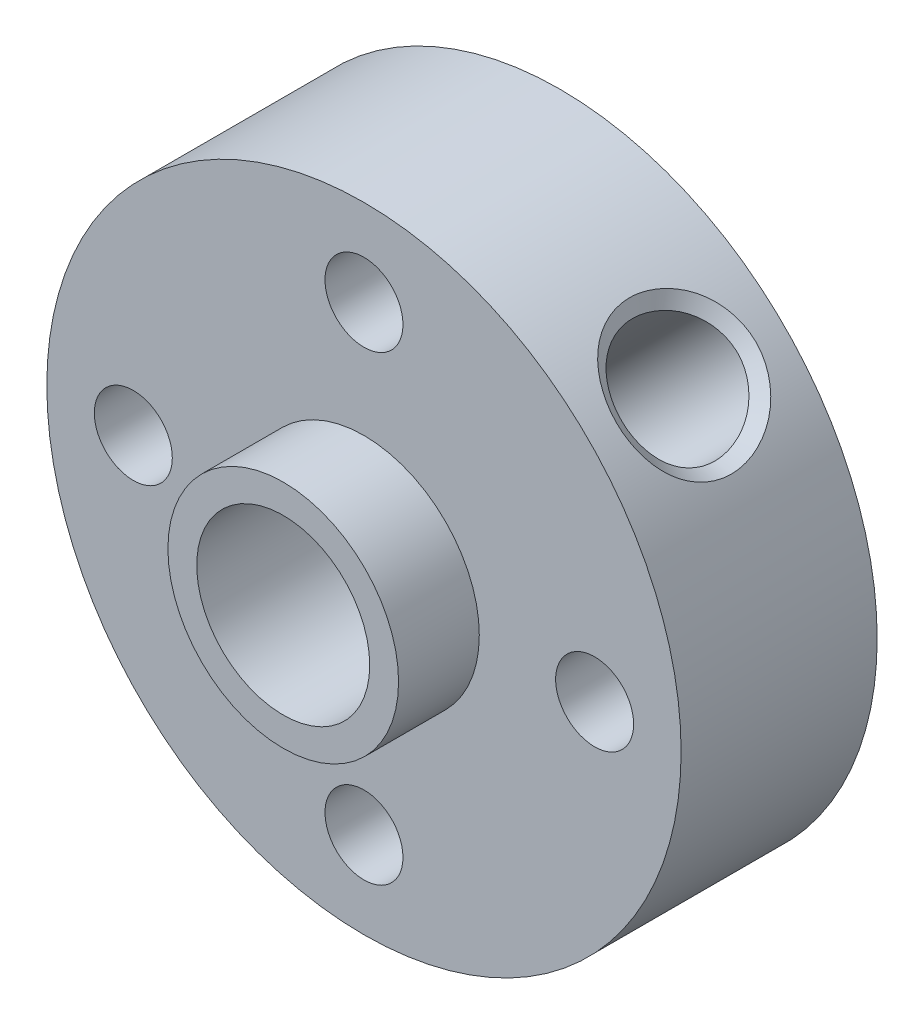
ISO-10303-21;
HEADER;
FILE_DESCRIPTION(('STEP AP214'),'2;1');
FILE_NAME('part.step','',(''),(''),'','','');
FILE_SCHEMA(('AUTOMOTIVE_DESIGN { 1 0 10303 214 1 1 1 1 }'));
ENDSEC;
DATA;
#1=APPLICATION_CONTEXT('core data for automotive mechanical design processes');
#2=APPLICATION_PROTOCOL_DEFINITION('international standard','automotive_design',2000,#1);
#3=PRODUCT_CONTEXT('',#1,'mechanical');
#4=PRODUCT('Part','Part','',(#3));
#5=PRODUCT_RELATED_PRODUCT_CATEGORY('part','',(#4));
#6=PRODUCT_DEFINITION_FORMATION('','',#4);
#7=PRODUCT_DEFINITION_CONTEXT('part definition',#1,'design');
#8=PRODUCT_DEFINITION('design','',#6,#7);
#9=PRODUCT_DEFINITION_SHAPE('','',#8);
#10=(LENGTH_UNIT() NAMED_UNIT(*) SI_UNIT(.MILLI.,.METRE.));
#11=(NAMED_UNIT(*) PLANE_ANGLE_UNIT() SI_UNIT($,.RADIAN.));
#12=(NAMED_UNIT(*) SI_UNIT($,.STERADIAN.) SOLID_ANGLE_UNIT());
#13=UNCERTAINTY_MEASURE_WITH_UNIT(LENGTH_MEASURE(1.E-05),#10,'distance_accuracy_value','');
#14=(GEOMETRIC_REPRESENTATION_CONTEXT(3) GLOBAL_UNCERTAINTY_ASSIGNED_CONTEXT((#13)) GLOBAL_UNIT_ASSIGNED_CONTEXT((#10,
#11,#12)) REPRESENTATION_CONTEXT('',''));
#15=CARTESIAN_POINT('',(0.,0.,0.));
#16=DIRECTION('',(0.,0.,1.));
#17=DIRECTION('',(1.,0.,0.));
#18=AXIS2_PLACEMENT_3D('',#15,#16,#17);
#19=CARTESIAN_POINT('',(0.,0.,3.4));
#20=DIRECTION('',(0.,0.,1.));
#21=DIRECTION('',(1.,0.,0.));
#22=AXIS2_PLACEMENT_3D('',#19,#20,#21);
#23=PLANE('',#22);
#24=CARTESIAN_POINT('',(0.,8.,3.4));
#25=DIRECTION('',(0.,0.,1.));
#26=DIRECTION('',(1.,0.,0.));
#27=AXIS2_PLACEMENT_3D('',#24,#25,#26);
#28=CIRCLE('',#27,1.35254999999999);
#29=CARTESIAN_POINT('',(1.35254999999999,8.,3.4));
#30=VERTEX_POINT('',#29);
#31=EDGE_CURVE('E165',#30,#30,#28,.T.);
#32=ORIENTED_EDGE('',*,*,#31,.F.);
#33=EDGE_LOOP('',(#32));
#34=FACE_BOUND('',#33,.T.);
#35=CARTESIAN_POINT('',(-8.,0.,3.4));
#36=DIRECTION('',(0.,0.,1.));
#37=DIRECTION('',(1.,0.,0.));
#38=AXIS2_PLACEMENT_3D('',#35,#36,#37);
#39=CIRCLE('',#38,1.35254999999999);
#40=CARTESIAN_POINT('',(-6.64745000000002,0.,3.4));
#41=VERTEX_POINT('',#40);
#42=EDGE_CURVE('E157',#41,#41,#39,.T.);
#43=ORIENTED_EDGE('',*,*,#42,.F.);
#44=EDGE_LOOP('',(#43));
#45=FACE_BOUND('',#44,.T.);
#46=CARTESIAN_POINT('',(8.,0.,3.4));
#47=DIRECTION('',(0.,0.,1.));
#48=DIRECTION('',(1.,0.,0.));
#49=AXIS2_PLACEMENT_3D('',#46,#47,#48);
#50=CIRCLE('',#49,1.35254999999999);
#51=CARTESIAN_POINT('',(9.35254999999998,0.,3.4));
#52=VERTEX_POINT('',#51);
#53=EDGE_CURVE('E152',#52,#52,#50,.T.);
#54=ORIENTED_EDGE('',*,*,#53,.F.);
#55=EDGE_LOOP('',(#54));
#56=FACE_BOUND('',#55,.T.);
#57=CARTESIAN_POINT('',(0.,-8.,3.4));
#58=DIRECTION('',(0.,0.,1.));
#59=DIRECTION('',(1.,0.,0.));
#60=AXIS2_PLACEMENT_3D('',#57,#58,#59);
#61=CIRCLE('',#60,1.35254999999999);
#62=CARTESIAN_POINT('',(1.35254999999999,-8.,3.4));
#63=VERTEX_POINT('',#62);
#64=EDGE_CURVE('E75',#63,#63,#61,.T.);
#65=ORIENTED_EDGE('',*,*,#64,.F.);
#66=EDGE_LOOP('',(#65));
#67=FACE_BOUND('',#66,.T.);
#68=CARTESIAN_POINT('',(0.,0.,3.4));
#69=DIRECTION('',(0.,0.,1.));
#70=DIRECTION('',(1.,0.,0.));
#71=AXIS2_PLACEMENT_3D('',#68,#69,#70);
#72=CIRCLE('',#71,11.);
#73=CARTESIAN_POINT('',(11.,0.,3.4));
#74=VERTEX_POINT('',#73);
#75=EDGE_CURVE('E36',#74,#74,#72,.T.);
#76=ORIENTED_EDGE('',*,*,#75,.T.);
#77=EDGE_LOOP('',(#76));
#78=FACE_BOUND('',#77,.T.);
#79=CARTESIAN_POINT('',(0.,0.,3.4));
#80=DIRECTION('',(0.,0.,1.));
#81=DIRECTION('',(1.,0.,0.));
#82=AXIS2_PLACEMENT_3D('',#79,#80,#81);
#83=CIRCLE('',#82,4.);
#84=CARTESIAN_POINT('',(4.,0.,3.4));
#85=VERTEX_POINT('',#84);
#86=EDGE_CURVE('E44',#85,#85,#83,.T.);
#87=ORIENTED_EDGE('',*,*,#86,.F.);
#88=EDGE_LOOP('',(#87));
#89=FACE_BOUND('',#88,.T.);
#90=ADVANCED_FACE('F14',(#34,#45,#56,#67,#78,#89),#23,.T.);
#91=CARTESIAN_POINT('',(0.,0.,-3.4));
#92=DIRECTION('',(0.,0.,1.));
#93=DIRECTION('',(1.,0.,0.));
#94=AXIS2_PLACEMENT_3D('',#91,#92,#93);
#95=CYLINDRICAL_SURFACE('',#94,11.);
#96=CARTESIAN_POINT('',(5.80850921114971,9.34137145948008,0.));
#97=CARTESIAN_POINT('',(5.80860175270186,9.34130684226353,0.637752239425181));
#98=CARTESIAN_POINT('',(6.04841944563921,9.19795689630476,1.26506432985481));
#99=CARTESIAN_POINT('',(6.80772994268232,8.6547578245762,2.1593530444314));
#100=CARTESIAN_POINT('',(7.31255506753503,8.24383991985221,2.42181611028022));
#101=CARTESIAN_POINT('',(8.24208780154512,7.31421539613681,2.42137394363942));
#102=CARTESIAN_POINT('',(8.65342910417239,6.80927509037896,2.16023058528547));
#103=CARTESIAN_POINT('',(9.19833006953286,6.04820111625001,1.26575073384544));
#104=CARTESIAN_POINT('',(9.34130756360716,5.80859981124356,0.640244269694807));
#105=CARTESIAN_POINT('',(9.34143535072448,5.80841861849953,-0.63996115444348));
#106=CARTESIAN_POINT('',(9.19862099961548,6.04773368941902,-1.26485137218771));
#107=CARTESIAN_POINT('',(8.65403117260026,6.8085025567722,-2.15966842361701));
#108=CARTESIAN_POINT('',(8.24214650834189,7.31418190369822,-2.42143639363606));
#109=CARTESIAN_POINT('',(7.31242801405934,8.24394174367863,-2.42175361413118));
#110=CARTESIAN_POINT('',(6.80825671047602,8.65433029295559,-2.15959971653594));
#111=CARTESIAN_POINT('',(6.04869975760828,9.19780320357039,-1.26576913530237));
#112=CARTESIAN_POINT('',(5.80841666959756,9.34143607669663,-0.637752239425181));
#113=CARTESIAN_POINT('',(5.80850921114971,9.34137145948008,0.));
#114=B_SPLINE_CURVE_WITH_KNOTS('',3,(#96,#97,#98,#99,#100,#101,#102,#103,#104,#105,#106,#107,
#108,#109,#110,#111,#112,#113),.UNSPECIFIED.,.T.,.F.,(4,2,2,2,2,2,2,2,4),(-3.18999496817969E-06,
0.00189587305523977,0.00379493610544774,0.00569399915565569,0.00759306220586365,
0.0094921252560716,0.0113911883062796,0.0132902513564875,0.0151893144066955),.UNSPECIFIED.);
#115=CARTESIAN_POINT('',(5.80850921114971,9.34137145948008,0.));
#116=VERTEX_POINT('',#115);
#117=EDGE_CURVE('E9',#116,#116,#114,.F.);
#118=ORIENTED_EDGE('',*,*,#117,.T.);
#119=EDGE_LOOP('',(#118));
#120=FACE_BOUND('',#119,.T.);
#121=CARTESIAN_POINT('',(0.,0.,-3.4));
#122=DIRECTION('',(0.,0.,1.));
#123=DIRECTION('',(1.,0.,0.));
#124=AXIS2_PLACEMENT_3D('',#121,#122,#123);
#125=CIRCLE('',#124,11.);
#126=CARTESIAN_POINT('',(11.,0.,-3.4));
#127=VERTEX_POINT('',#126);
#128=EDGE_CURVE('E31',#127,#127,#125,.T.);
#129=ORIENTED_EDGE('',*,*,#128,.T.);
#130=EDGE_LOOP('',(#129));
#131=FACE_BOUND('',#130,.T.);
#132=ORIENTED_EDGE('',*,*,#75,.F.);
#133=EDGE_LOOP('',(#132));
#134=FACE_BOUND('',#133,.T.);
#135=ADVANCED_FACE('F90',(#120,#131,#134),#95,.T.);
#136=CARTESIAN_POINT('',(0.,0.,-3.4));
#137=DIRECTION('',(0.,0.,1.));
#138=DIRECTION('',(1.,0.,0.));
#139=AXIS2_PLACEMENT_3D('',#136,#137,#138);
#140=PLANE('',#139);
#141=CARTESIAN_POINT('',(0.,8.,-3.4));
#142=DIRECTION('',(0.,0.,1.));
#143=DIRECTION('',(1.,0.,0.));
#144=AXIS2_PLACEMENT_3D('',#141,#142,#143);
#145=CIRCLE('',#144,1.35255);
#146=CARTESIAN_POINT('',(1.35255,8.,-3.4));
#147=VERTEX_POINT('',#146);
#148=EDGE_CURVE('E168',#147,#147,#145,.T.);
#149=ORIENTED_EDGE('',*,*,#148,.T.);
#150=EDGE_LOOP('',(#149));
#151=FACE_BOUND('',#150,.T.);
#152=CARTESIAN_POINT('',(-8.,0.,-3.4));
#153=DIRECTION('',(0.,0.,1.));
#154=DIRECTION('',(1.,0.,0.));
#155=AXIS2_PLACEMENT_3D('',#152,#153,#154);
#156=CIRCLE('',#155,1.35255);
#157=CARTESIAN_POINT('',(-6.64745,0.,-3.4));
#158=VERTEX_POINT('',#157);
#159=EDGE_CURVE('E162',#158,#158,#156,.T.);
#160=ORIENTED_EDGE('',*,*,#159,.T.);
#161=EDGE_LOOP('',(#160));
#162=FACE_BOUND('',#161,.T.);
#163=CARTESIAN_POINT('',(8.,0.,-3.4));
#164=DIRECTION('',(0.,0.,1.));
#165=DIRECTION('',(1.,0.,0.));
#166=AXIS2_PLACEMENT_3D('',#163,#164,#165);
#167=CIRCLE('',#166,1.35255);
#168=CARTESIAN_POINT('',(9.35255,0.,-3.4));
#169=VERTEX_POINT('',#168);
#170=EDGE_CURVE('E149',#169,#169,#167,.T.);
#171=ORIENTED_EDGE('',*,*,#170,.T.);
#172=EDGE_LOOP('',(#171));
#173=FACE_BOUND('',#172,.T.);
#174=CARTESIAN_POINT('',(0.,-8.,-3.4));
#175=DIRECTION('',(0.,0.,1.));
#176=DIRECTION('',(1.,0.,0.));
#177=AXIS2_PLACEMENT_3D('',#174,#175,#176);
#178=CIRCLE('',#177,1.35255);
#179=CARTESIAN_POINT('',(1.35255,-8.,-3.4));
#180=VERTEX_POINT('',#179);
#181=EDGE_CURVE('E154',#180,#180,#178,.T.);
#182=ORIENTED_EDGE('',*,*,#181,.T.);
#183=EDGE_LOOP('',(#182));
#184=FACE_BOUND('',#183,.T.);
#185=CARTESIAN_POINT('',(0.,0.,-3.4));
#186=DIRECTION('',(0.,0.,1.));
#187=DIRECTION('',(1.,0.,0.));
#188=AXIS2_PLACEMENT_3D('',#185,#186,#187);
#189=CIRCLE('',#188,3.);
#190=CARTESIAN_POINT('',(3.,0.,-3.4));
#191=VERTEX_POINT('',#190);
#192=EDGE_CURVE('E77',#191,#191,#189,.T.);
#193=ORIENTED_EDGE('',*,*,#192,.T.);
#194=EDGE_LOOP('',(#193));
#195=FACE_BOUND('',#194,.T.);
#196=ORIENTED_EDGE('',*,*,#128,.F.);
#197=EDGE_LOOP('',(#196));
#198=FACE_BOUND('',#197,.T.);
#199=ADVANCED_FACE('F98',(#151,#162,#173,#184,#195,#198),#140,.F.);
#200=CARTESIAN_POINT('',(0.,0.,6.2));
#201=DIRECTION('',(0.,0.,-1.));
#202=DIRECTION('',(-1.,0.,0.));
#203=AXIS2_PLACEMENT_3D('',#200,#201,#202);
#204=CYLINDRICAL_SURFACE('',#203,4.);
#205=CARTESIAN_POINT('',(0.,0.,6.2));
#206=DIRECTION('',(0.,0.,1.));
#207=DIRECTION('',(1.,0.,0.));
#208=AXIS2_PLACEMENT_3D('',#205,#206,#207);
#209=CIRCLE('',#208,4.);
#210=CARTESIAN_POINT('',(4.,0.,6.2));
#211=VERTEX_POINT('',#210);
#212=EDGE_CURVE('E41',#211,#211,#209,.T.);
#213=ORIENTED_EDGE('',*,*,#212,.F.);
#214=EDGE_LOOP('',(#213));
#215=FACE_BOUND('',#214,.T.);
#216=ORIENTED_EDGE('',*,*,#86,.T.);
#217=EDGE_LOOP('',(#216));
#218=FACE_BOUND('',#217,.T.);
#219=ADVANCED_FACE('F87',(#215,#218),#204,.T.);
#220=CARTESIAN_POINT('',(0.,0.,6.2));
#221=DIRECTION('',(0.,0.,1.));
#222=DIRECTION('',(1.,0.,0.));
#223=AXIS2_PLACEMENT_3D('',#220,#221,#222);
#224=PLANE('',#223);
#225=CARTESIAN_POINT('',(0.,0.,6.2));
#226=DIRECTION('',(0.,0.,1.));
#227=DIRECTION('',(1.,0.,0.));
#228=AXIS2_PLACEMENT_3D('',#225,#226,#227);
#229=CIRCLE('',#228,3.);
#230=CARTESIAN_POINT('',(3.,0.,6.2));
#231=VERTEX_POINT('',#230);
#232=EDGE_CURVE('E74',#231,#231,#229,.T.);
#233=ORIENTED_EDGE('',*,*,#232,.F.);
#234=EDGE_LOOP('',(#233));
#235=FACE_BOUND('',#234,.T.);
#236=ORIENTED_EDGE('',*,*,#212,.T.);
#237=EDGE_LOOP('',(#236));
#238=FACE_BOUND('',#237,.T.);
#239=ADVANCED_FACE('F183',(#235,#238),#224,.T.);
#240=CARTESIAN_POINT('',(0.,0.,-3.4));
#241=DIRECTION('',(0.,0.,1.));
#242=DIRECTION('',(1.,0.,0.));
#243=AXIS2_PLACEMENT_3D('',#240,#241,#242);
#244=CYLINDRICAL_SURFACE('',#243,3.);
#245=CARTESIAN_POINT('',(0.140964874131704,2.99668632063168,0.));
#246=CARTESIAN_POINT('',(0.140973596425941,2.99668877876177,0.098267140159155));
#247=CARTESIAN_POINT('',(0.150783604937548,2.99627297936712,0.196560340717473));
#248=CARTESIAN_POINT('',(0.188643120098594,2.99411844316388,0.389604395758761));
#249=CARTESIAN_POINT('',(0.216725857438611,2.99237729510123,0.484348463165478));
#250=CARTESIAN_POINT('',(0.287566324055804,2.98639263110845,0.66688445970502));
#251=CARTESIAN_POINT('',(0.330177706650297,2.98217377806388,0.75473536524163));
#252=CARTESIAN_POINT('',(0.426893750215522,2.96987148458312,0.923482005054036));
#253=CARTESIAN_POINT('',(0.481000510439045,2.96178733794049,1.00437646516826));
#254=CARTESIAN_POINT('',(0.607371814508557,2.93868158824322,1.17102358549829));
#255=CARTESIAN_POINT('',(0.681155761442132,2.92276043053348,1.25549942358805));
#256=CARTESIAN_POINT('',(0.837366259695036,2.88190070504922,1.41373187372428));
#257=CARTESIAN_POINT('',(0.919802265197736,2.8569521986231,1.48747654534154));
#258=CARTESIAN_POINT('',(1.10320182024356,2.79173209928646,1.63306183144041));
#259=CARTESIAN_POINT('',(1.20509710343995,2.74973294137712,1.70298665445154));
#260=CARTESIAN_POINT('',(1.4119470706209,2.64944107376143,1.82407543706995));
#261=CARTESIAN_POINT('',(1.5168957838101,2.59117846972164,1.87527366118514));
#262=CARTESIAN_POINT('',(1.6983111335789,2.47472666269574,1.9455593679438));
#263=CARTESIAN_POINT('',(1.77528377164386,2.42022704728202,1.96948922093329));
#264=CARTESIAN_POINT('',(1.92547501725124,2.30252473801262,2.00392935112861));
#265=CARTESIAN_POINT('',(1.99869643227694,2.2393286872687,2.01444980926693));
#266=CARTESIAN_POINT('',(2.13910271892289,2.10562450185853,2.02149290497818));
#267=CARTESIAN_POINT('',(2.20627759644525,2.03510466171401,2.01799278762426));
#268=CARTESIAN_POINT('',(2.33255181669655,1.88905481044295,1.99715109462227));
#269=CARTESIAN_POINT('',(2.39164876160439,1.81352332151886,1.9798054195195));
#270=CARTESIAN_POINT('',(2.49971448548471,1.6613245603167,1.93261511708822));
#271=CARTESIAN_POINT('',(2.54883956691533,1.58469897586444,1.90298992616388));
#272=CARTESIAN_POINT('',(2.63800401251086,1.43136695290519,1.83253576097941));
#273=CARTESIAN_POINT('',(2.67804165557309,1.35466050184169,1.7917046676226));
#274=CARTESIAN_POINT('',(2.75345510104509,1.19463975046345,1.69496537461078));
#275=CARTESIAN_POINT('',(2.787796675907,1.11155525713123,1.63787646031066));
#276=CARTESIAN_POINT('',(2.84685752106799,0.950160561205841,1.51289259923298));
#277=CARTESIAN_POINT('',(2.87156539243244,0.871856106322447,1.44498498434907));
#278=CARTESIAN_POINT('',(2.91617925734933,0.709970040641031,1.28735653708993));
#279=CARTESIAN_POINT('',(2.93460347692185,0.627676256550689,1.19588619316171));
#280=CARTESIAN_POINT('',(2.96281033229786,0.477090854407041,1.00082926242336));
#281=CARTESIAN_POINT('',(2.97259833935265,0.408790553499582,0.897250252007682));
#282=CARTESIAN_POINT('',(2.98472399555785,0.305700690591401,0.705076019136407));
#283=CARTESIAN_POINT('',(2.98827953437657,0.266804690510231,0.618771187162269));
#284=CARTESIAN_POINT('',(2.9932640661576,0.20344642709279,0.441001259055672));
#285=CARTESIAN_POINT('',(2.99469691073788,0.178958069975086,0.349545822562629));
#286=CARTESIAN_POINT('',(2.99644764308712,0.146905797540694,0.162887188750376));
#287=CARTESIAN_POINT('',(2.99675683226214,0.139474085605024,0.0676604975433));
#288=CARTESIAN_POINT('',(2.9965921652876,0.142957841234305,-0.122460732300091));
#289=CARTESIAN_POINT('',(2.99611823788278,0.153874978350537,-0.217355239923924));
#290=CARTESIAN_POINT('',(2.99399098429709,0.190510510754693,-0.393616029634496));
#291=CARTESIAN_POINT('',(2.99246806736947,0.214536399222093,-0.475349718918807));
#292=CARTESIAN_POINT('',(2.98761013947686,0.273996768931334,-0.634495549889999));
#293=CARTESIAN_POINT('',(2.98427350540983,0.30944145730809,-0.711903752153196));
#294=CARTESIAN_POINT('',(2.97276792056859,0.407474824178516,-0.895005102536816));
#295=CARTESIAN_POINT('',(2.96310685021584,0.475117716846531,-0.997902056013123));
#296=CARTESIAN_POINT('',(2.93530525081688,0.624307012293902,-1.1918810771684));
#297=CARTESIAN_POINT('',(2.91714920976135,0.705878675557201,-1.28294114009789));
#298=CARTESIAN_POINT('',(2.86951418569794,0.879847726851796,-1.45317948195013));
#299=CARTESIAN_POINT('',(2.83989321425106,0.972370343170876,-1.53219071618379));
#300=CARTESIAN_POINT('',(2.76706735719638,1.16351196906968,-1.67500399877634));
#301=CARTESIAN_POINT('',(2.72388451741606,1.26212087737287,-1.73883043728458));
#302=CARTESIAN_POINT('',(2.63147402705235,1.44352768804252,-1.83891618100895));
#303=CARTESIAN_POINT('',(2.58472178406086,1.52598736934383,-1.87806706719257));
#304=CARTESIAN_POINT('',(2.48079979491718,1.68967604018048,-1.94283627640381));
#305=CARTESIAN_POINT('',(2.42363680374714,1.77090579094942,-1.9684633325463));
#306=CARTESIAN_POINT('',(2.29931281205703,1.92960053352643,-2.00489733174875));
#307=CARTESIAN_POINT('',(2.23210753109171,2.00704672689031,-2.01563635576009));
#308=CARTESIAN_POINT('',(2.08973540745282,2.1548847498933,-2.02138037996191));
#309=CARTESIAN_POINT('',(2.01456988198504,2.22527774290684,-2.01638797935981));
#310=CARTESIAN_POINT('',(1.86495146837063,2.35177058731536,-1.99198783716143));
#311=CARTESIAN_POINT('',(1.790883027932,2.40855160452958,-1.9737107864744));
#312=CARTESIAN_POINT('',(1.64061098326316,2.51332292185118,-1.92496500434514));
#313=CARTESIAN_POINT('',(1.5644070389501,2.56131181251842,-1.89449432066586));
#314=CARTESIAN_POINT('',(1.40792958231886,2.65071645149137,-1.82063779440984));
#315=CARTESIAN_POINT('',(1.32766176522853,2.69162825481495,-1.7766360099734));
#316=CARTESIAN_POINT('',(1.16951120459241,2.76402268465499,-1.67792532616774));
#317=CARTESIAN_POINT('',(1.09162983972056,2.79549994963953,-1.62321036772058));
#318=CARTESIAN_POINT('',(0.928302223601383,2.85428183648066,-1.49489928218128));
#319=CARTESIAN_POINT('',(0.843606433218719,2.88014015450953,-1.4196856967384));
#320=CARTESIAN_POINT('',(0.683120162751906,2.92236843279855,-1.25783818901386));
#321=CARTESIAN_POINT('',(0.607336969846977,2.93873067122702,-1.17119504273096));
#322=CARTESIAN_POINT('',(0.472662666130018,2.96327075304597,-0.993172326488883));
#323=CARTESIAN_POINT('',(0.413007984872816,2.97189939899243,-0.902435363617874));
#324=CARTESIAN_POINT('',(0.308525072370767,2.98455844193639,-0.712517066078894));
#325=CARTESIAN_POINT('',(0.26367022825823,2.98859712487761,-0.613351296432072));
#326=CARTESIAN_POINT('',(0.200250851842448,2.99344447063229,-0.428720030428275));
#327=CARTESIAN_POINT('',(0.178227081671669,2.99473669600436,-0.344466780193642));
#328=CARTESIAN_POINT('',(0.148588007584803,2.99635601576172,-0.173480606452646));
#329=CARTESIAN_POINT('',(0.140957174070217,2.99668415058877,-0.0867504581809685));
#330=CARTESIAN_POINT('',(0.140964874131704,2.99668632063168,0.));
#331=B_SPLINE_CURVE_WITH_KNOTS('',3,(#245,#246,#247,#248,#249,#250,#251,#252,#253,#254,#255,
#256,#257,#258,#259,#260,#261,#262,#263,#264,#265,#266,#267,#268,#269,#270,#271,#272,#273,#274,
#275,#276,#277,#278,#279,#280,#281,#282,#283,#284,#285,#286,#287,#288,#289,#290,#291,#292,#293,
#294,#295,#296,#297,#298,#299,#300,#301,#302,#303,#304,#305,#306,#307,#308,#309,#310,#311,#312,
#313,#314,#315,#316,#317,#318,#319,#320,#321,#322,#323,#324,#325,#326,#327,#328,#329,#330),
.UNSPECIFIED.,.T.,.F.,(4,2,2,2,2,2,2,2,2,2,2,2,2,2,2,2,2,2,2,2,2,2,2,2,2,2,2,2,2,2,2,2,2,2,2,2,
2,2,2,2,2,2,4),(0.,0.294403536380051,0.589343975595897,0.881397200780219,1.17350380579789,
1.51211387476107,1.85109787614565,2.24051778682945,2.62922155934116,2.91986353918584,
3.21028472066951,3.50117743686839,3.79215631384675,4.0781454004206,4.36418860638471,
4.68247532658299,5.00113752008124,5.37279099606919,5.7442131606791,6.02735164683166,
6.3099757476852,6.59478313131645,6.8796164308116,7.13424228210731,7.38909637504133,
7.75770005887129,8.12697946404345,8.50098664778866,8.87438897473934,9.18078287749255,
9.48697868121594,9.79456680098563,10.1021041025096,10.3861411287428,10.6702236483578,
10.9698648671405,11.2696760468771,11.6168834583152,11.9643728107565,12.2899631035632,
12.6149646923712,12.8751457033016,13.1350458248448),.UNSPECIFIED.);
#332=CARTESIAN_POINT('',(0.140964874131704,2.99668632063168,0.));
#333=VERTEX_POINT('',#332);
#334=EDGE_CURVE('E68',#333,#333,#331,.T.);
#335=ORIENTED_EDGE('',*,*,#334,.T.);
#336=EDGE_LOOP('',(#335));
#337=FACE_BOUND('',#336,.T.);
#338=ORIENTED_EDGE('',*,*,#192,.F.);
#339=EDGE_LOOP('',(#338));
#340=FACE_BOUND('',#339,.T.);
#341=ORIENTED_EDGE('',*,*,#232,.T.);
#342=EDGE_LOOP('',(#341));
#343=FACE_BOUND('',#342,.T.);
#344=ADVANCED_FACE('F62',(#337,#340,#343),#244,.F.);
#345=CARTESIAN_POINT('',(7.77817459305204,7.77817459305201,0.));
#346=DIRECTION('',(0.707106781186549,0.707106781186546,0.));
#347=DIRECTION('',(-0.707106781186546,0.707106781186549,0.));
#348=AXIS2_PLACEMENT_3D('',#345,#346,#347);
#349=CYLINDRICAL_SURFACE('',#348,2.0193);
#350=CARTESIAN_POINT('',(5.91506401697902,8.77078546347897,0.));
#351=CARTESIAN_POINT('',(5.91505848231522,8.77078895441068,-0.0332110676749033));
#352=CARTESIAN_POINT('',(5.91584250371787,8.77036908136087,-0.0664205027334047));
#353=CARTESIAN_POINT('',(5.91894801804012,8.7686844720424,-0.132706000824395));
#354=CARTESIAN_POINT('',(5.9212676546673,8.76742075581777,-0.165782176435809));
#355=CARTESIAN_POINT('',(5.92740096477233,8.76405141279832,-0.231730396913036));
#356=CARTESIAN_POINT('',(5.93121367555311,8.7619463284787,-0.264602559475341));
#357=CARTESIAN_POINT('',(5.94028892447994,8.75689761117119,-0.33007339450582));
#358=CARTESIAN_POINT('',(5.94555114052323,8.7539541644756,-0.362672126078209));
#359=CARTESIAN_POINT('',(5.95748172497235,8.74723181556497,-0.427526437618056));
#360=CARTESIAN_POINT('',(5.96415019887331,8.74345285066972,-0.4597819916501));
#361=CARTESIAN_POINT('',(5.97884975539384,8.73506249034032,-0.523880394046932));
#362=CARTESIAN_POINT('',(5.98688119889341,8.73045087442044,-0.5557231306983));
#363=CARTESIAN_POINT('',(6.00426333819006,8.72039813550141,-0.618926309415745));
#364=CARTESIAN_POINT('',(6.01361451659092,8.71495670899628,-0.650286570375672));
#365=CARTESIAN_POINT('',(6.03359289306655,8.70324720139475,-0.712455190591768));
#366=CARTESIAN_POINT('',(6.04422059736454,8.69697879224987,-0.74326332529229));
#367=CARTESIAN_POINT('',(6.06670888670971,8.68361811087546,-0.804258051751262));
#368=CARTESIAN_POINT('',(6.07856993563723,8.67652552854269,-0.834444404496179));
#369=CARTESIAN_POINT('',(6.10348184418441,8.66151925847352,-0.894125891486494));
#370=CARTESIAN_POINT('',(6.1165330880074,8.65360530547821,-0.923620798638449));
#371=CARTESIAN_POINT('',(6.14378232701951,8.63695899466251,-0.981849692064889));
#372=CARTESIAN_POINT('',(6.15798061459986,8.62822642807898,-1.01058348182969));
#373=CARTESIAN_POINT('',(6.18748098358667,8.60994569245589,-1.06722040540461));
#374=CARTESIAN_POINT('',(6.20278327541987,8.60039736786602,-1.0951233794192));
#375=CARTESIAN_POINT('',(6.23444834486617,8.58048749877546,-1.15002897367342));
#376=CARTESIAN_POINT('',(6.25081127954806,8.57012583378044,-1.17703145966052));
#377=CARTESIAN_POINT('',(6.28455556770699,8.54859326407028,-1.23006622575014));
#378=CARTESIAN_POINT('',(6.30193706947596,8.53742224146553,-1.25609836367374));
#379=CARTESIAN_POINT('',(6.33767164204864,8.51426907303072,-1.30712323462616));
#380=CARTESIAN_POINT('',(6.35602490834893,8.50228676385234,-1.33211575668862));
#381=CARTESIAN_POINT('',(6.39367379710448,8.47753119815555,-1.38098995191833));
#382=CARTESIAN_POINT('',(6.41296973283744,8.46475767831074,-1.40487125057307));
#383=CARTESIAN_POINT('',(6.45239380966425,8.43836765389058,-1.45144277207453));
#384=CARTESIAN_POINT('',(6.47252179241438,8.42475130946691,-1.47413321969916));
#385=CARTESIAN_POINT('',(6.5134758800685,8.396649933525,-1.51827896365429));
#386=CARTESIAN_POINT('',(6.53430150189429,8.38216549784591,-1.53973508781517));
#387=CARTESIAN_POINT('',(6.57659692078658,8.35237560191872,-1.58137915482345));
#388=CARTESIAN_POINT('',(6.59806639414692,8.33707055129586,-1.60156771966928));
#389=CARTESIAN_POINT('',(6.64157796071987,8.30566497179512,-1.64064582304461));
#390=CARTESIAN_POINT('',(6.66361982921347,8.28956475292206,-1.65953586105513));
#391=CARTESIAN_POINT('',(6.70820943365555,8.2566002077917,-1.69598536565466));
#392=CARTESIAN_POINT('',(6.73075699607696,8.23973614168032,-1.71354527988383));
#393=CARTESIAN_POINT('',(6.77629000761417,8.20527364445818,-1.74730308237524));
#394=CARTESIAN_POINT('',(6.79927530942781,8.18767545809094,-1.76350141922008));
#395=CARTESIAN_POINT('',(6.84561618019307,8.15177485327988,-1.79450451369917));
#396=CARTESIAN_POINT('',(6.8689716177549,8.13347268158225,-1.80930975345408));
#397=CARTESIAN_POINT('',(6.91598505694102,8.09619410943873,-1.83749507829371));
#398=CARTESIAN_POINT('',(6.93964294335847,8.07721796109371,-1.8508756889275));
#399=CARTESIAN_POINT('',(6.98719359976606,8.03862146663374,-1.87618016635322));
#400=CARTESIAN_POINT('',(7.01108627669856,8.01900136905854,-1.88810458698168));
#401=CARTESIAN_POINT('',(7.05903882080188,7.97914700798318,-1.91046511062842));
#402=CARTESIAN_POINT('',(7.08309862402779,7.95891297037337,-1.92090175318899));
#403=CARTESIAN_POINT('',(7.13131772267693,7.91786078233942,-1.94025519102211));
#404=CARTESIAN_POINT('',(7.15547698625862,7.89704280807243,-1.94917243903047));
#405=CARTESIAN_POINT('',(7.20382730656838,7.85485282469411,-1.96545562647138));
#406=CARTESIAN_POINT('',(7.22801835725751,7.83348090947037,-1.97282182688519));
#407=CARTESIAN_POINT('',(7.27636455934796,7.79021315756589,-1.9859715835014));
#408=CARTESIAN_POINT('',(7.30051970910263,7.76831729759626,-1.99175506921085));
#409=CARTESIAN_POINT('',(7.34872645183662,7.72403178920511,-2.0017081311534));
#410=CARTESIAN_POINT('',(7.37277800466268,7.7016419668764,-2.00587712907823));
#411=CARTESIAN_POINT('',(7.42070990754528,7.65639875033491,-2.01257039611203));
#412=CARTESIAN_POINT('',(7.44459010761541,7.63354500443547,-2.01509336544913));
#413=CARTESIAN_POINT('',(7.49211187188736,7.58740398851407,-2.01846297530972));
#414=CARTESIAN_POINT('',(7.51575306944567,7.56411617370421,-2.01930734284276));
#415=CARTESIAN_POINT('',(7.56268537381163,7.51718143523514,-2.01929214610317));
#416=CARTESIAN_POINT('',(7.58597640723569,7.49353443833363,-2.01843222954557));
#417=CARTESIAN_POINT('',(7.63213269087668,7.44599278654123,-2.01503739250119));
#418=CARTESIAN_POINT('',(7.65499833438958,7.42209839582679,-2.01250410727608));
#419=CARTESIAN_POINT('',(7.70027314745175,7.37413068840906,-2.00579376995031));
#420=CARTESIAN_POINT('',(7.72268252506742,7.35005746041972,-2.00161748558656));
#421=CARTESIAN_POINT('',(7.76701398076269,7.30180085174932,-1.99165308065752));
#422=CARTESIAN_POINT('',(7.78893610238859,7.2776174811464,-1.98586510476038));
#423=CARTESIAN_POINT('',(7.83226222533888,7.22920923113274,-1.97270874422235));
#424=CARTESIAN_POINT('',(7.85366613690358,7.20498434529829,-1.96534008793903));
#425=CARTESIAN_POINT('',(7.89592497299629,7.15656166922529,-1.94905366064103));
#426=CARTESIAN_POINT('',(7.91677971060389,7.13236389082917,-1.94013536983413));
#427=CARTESIAN_POINT('',(7.95790929380116,7.08406400516903,-1.92078078423956));
#428=CARTESIAN_POINT('',(7.97818389178886,7.05996194242694,-1.91034385253155));
#429=CARTESIAN_POINT('',(8.01812224950334,7.01192205696618,-1.88798297317344));
#430=CARTESIAN_POINT('',(8.03778573410585,6.98798431189645,-1.87605836754497));
#431=CARTESIAN_POINT('',(8.07647088550343,6.94034163726293,-1.85075303378893));
#432=CARTESIAN_POINT('',(8.09549227656628,6.91663681074189,-1.83737169026327));
#433=CARTESIAN_POINT('',(8.13286222382865,6.86952855499723,-1.80918371284057));
#434=CARTESIAN_POINT('',(8.15121052192307,6.8461252435794,-1.79437653992197));
#435=CARTESIAN_POINT('',(8.18720327904014,6.79968863480245,-1.76336770394077));
#436=CARTESIAN_POINT('',(8.20484750501893,6.77665546143918,-1.74716558467095));
#437=CARTESIAN_POINT('',(8.23940098478744,6.73102767566808,-1.71339764848218));
#438=CARTESIAN_POINT('',(8.25631002512714,6.70843319166701,-1.69583143959048));
#439=CARTESIAN_POINT('',(8.28936245658593,6.66375163283349,-1.65936614329797));
#440=CARTESIAN_POINT('',(8.30550563361525,6.64166470076169,-1.64046668682979));
#441=CARTESIAN_POINT('',(8.33699399859716,6.59806596681261,-1.6013657262551));
#442=CARTESIAN_POINT('',(8.35233893380897,6.57655434812704,-1.5811638142422));
#443=CARTESIAN_POINT('',(8.38220479917344,6.53417810328663,-1.53948894405403));
#444=CARTESIAN_POINT('',(8.39672538327564,6.51331375048717,-1.51801545970706));
#445=CARTESIAN_POINT('',(8.42489311596826,6.4722882785207,-1.47382811571225));
#446=CARTESIAN_POINT('',(8.43853973376537,6.45212759003504,-1.45111351751842));
#447=CARTESIAN_POINT('',(8.46498311220623,6.41264578919863,-1.4045022351673));
#448=CARTESIAN_POINT('',(8.47778006619722,6.39332448618788,-1.3806058221152));
#449=CARTESIAN_POINT('',(8.50257514167932,6.35563320480251,-1.33172197410268));
#450=CARTESIAN_POINT('',(8.51457408105177,6.33726225684294,-1.30673570103523));
#451=CARTESIAN_POINT('',(8.5377528699454,6.3015013268,-1.25573829303498));
#452=CARTESIAN_POINT('',(8.54893337535542,6.28411056183228,-1.22972800503157));
#453=CARTESIAN_POINT('',(8.57047851389438,6.25035520776225,-1.17674891016927));
#454=CARTESIAN_POINT('',(8.58084366898023,6.23398996354727,-1.14978073283481));
#455=CARTESIAN_POINT('',(8.60075497666371,6.20232675855255,-1.09495202742265));
#456=CARTESIAN_POINT('',(8.61030156068651,6.18702823636469,-1.06709198016873));
#457=CARTESIAN_POINT('',(8.62857424193247,6.15754073429502,-1.01054566085373));
#458=CARTESIAN_POINT('',(8.6373007052626,6.14335125980823,-0.98185976499946));
#459=CARTESIAN_POINT('',(8.65393118322941,6.11612384324089,-0.923727827713139));
#460=CARTESIAN_POINT('',(8.66183551201453,6.10308546160267,-0.894282082037684));
#461=CARTESIAN_POINT('',(8.67681986647411,6.07820231388728,-0.834696503956032));
#462=CARTESIAN_POINT('',(8.68390015394206,6.06635716888693,-0.804556895651183));
#463=CARTESIAN_POINT('',(8.69723453927415,6.04390255145558,-0.743649643103446));
#464=CARTESIAN_POINT('',(8.70348883246058,6.03329278696552,-0.712882149330103));
#465=CARTESIAN_POINT('',(8.71516936551008,6.01335096704361,-0.65078517879945));
#466=CARTESIAN_POINT('',(8.72059570606081,6.00401875626215,-0.619455770895428));
#467=CARTESIAN_POINT('',(8.73061849592326,5.98667402839745,-0.556301032430903));
#468=CARTESIAN_POINT('',(8.73521490889622,5.97866156910146,-0.524475680221499));
#469=CARTESIAN_POINT('',(8.74357604893017,5.96399825071929,-0.460395119679614));
#470=CARTESIAN_POINT('',(8.74734054591038,5.95734776834859,-0.428139795039581));
#471=CARTESIAN_POINT('',(8.75403611517924,5.94545020513707,-0.363265361084158));
#472=CARTESIAN_POINT('',(8.75696669272247,5.94020395750586,-0.330646047697538));
#473=CARTESIAN_POINT('',(8.76199275794242,5.93115651464901,-0.265109684300486));
#474=CARTESIAN_POINT('',(8.76408740155927,5.92735678017527,-0.232192367504743));
#475=CARTESIAN_POINT('',(8.76744000846942,5.9212438787935,-0.166126063866228));
#476=CARTESIAN_POINT('',(8.76869668102399,5.91893300538347,-0.132976798738421));
#477=CARTESIAN_POINT('',(8.77037188909036,5.91583898922573,-0.066512428263187));
#478=CARTESIAN_POINT('',(8.77078857901005,5.91505921066461,-0.0331971186146417));
#479=CARTESIAN_POINT('',(8.77078234422554,5.91506882985746,0.0334354198008994));
#480=CARTESIAN_POINT('',(8.77035936358661,5.91585833214921,0.0667526485478928));
#481=CARTESIAN_POINT('',(8.76867146473501,5.91897238819308,0.13322429658903));
#482=CARTESIAN_POINT('',(8.76740828879689,5.9212937652881,0.166378910068239));
#483=CARTESIAN_POINT('',(8.76404262761878,5.92742794695481,0.232458795725592));
#484=CARTESIAN_POINT('',(8.7619413437847,5.93123861650763,0.265384327842097));
#485=CARTESIAN_POINT('',(8.75690192757776,5.94030819641756,0.330939444120578));
#486=CARTESIAN_POINT('',(8.75396456516732,5.94556577413947,0.363569272205739));
#487=CARTESIAN_POINT('',(8.7472553538668,5.95748617552347,0.428466492217278));
#488=CARTESIAN_POINT('',(8.74348394143914,5.96414826411336,0.460734064467783));
#489=CARTESIAN_POINT('',(8.73510889001523,5.97883490576692,0.52484030722022));
#490=CARTESIAN_POINT('',(8.73050543884059,5.98685915131707,0.556679072780175));
#491=CARTESIAN_POINT('',(8.72046848535581,6.00422748816641,0.619861251959679));
#492=CARTESIAN_POINT('',(8.71503499303038,6.01357156358902,0.651204671532828));
#493=CARTESIAN_POINT('',(8.70334006221747,6.03353707477466,0.713329703342666));
#494=CARTESIAN_POINT('',(8.69707851221822,6.04415868256126,0.744111239275858));
#495=CARTESIAN_POINT('',(8.68372951263668,6.06663687147066,0.805046035453233));
#496=CARTESIAN_POINT('',(8.67664187185276,6.0784937384309,0.83519914833535));
#497=CARTESIAN_POINT('',(8.66164270405434,6.10340013586137,0.894810613656917));
#498=CARTESIAN_POINT('',(8.65373093354436,6.11645001867717,0.924268757591395));
#499=CARTESIAN_POINT('',(8.63708546101234,6.1437001608459,0.982423787635083));
#500=CARTESIAN_POINT('',(8.62835147637857,6.1579008155074,1.01112040761647));
#501=CARTESIAN_POINT('',(8.61006363456531,6.18741031938702,1.0676858834715));
#502=CARTESIAN_POINT('',(8.60050945492705,6.20271960408834,1.09555440793039));
#503=CARTESIAN_POINT('',(8.58058284492023,6.23440387837896,1.15039720437352));
#504=CARTESIAN_POINT('',(8.57021003759893,6.25077935830366,1.17737105617334));
#505=CARTESIAN_POINT('',(8.54864944445045,6.2845546751928,1.23035799961978));
#506=CARTESIAN_POINT('',(8.53746120026439,6.30195508720329,1.25637053833628));
#507=CARTESIAN_POINT('',(8.5142669232988,6.33773457120861,1.30736855221933));
#508=CARTESIAN_POINT('',(8.50226030619904,6.3561143403794,1.33235327267238));
#509=CARTESIAN_POINT('',(8.47744934140314,6.3938229438881,1.38122882200797));
#510=CARTESIAN_POINT('',(8.46464425050445,6.41315265876081,1.4051185947489));
#511=CARTESIAN_POINT('',(8.43818660196548,6.45264810788821,1.45171251711371));
#512=CARTESIAN_POINT('',(8.42453397317264,6.472813912287,1.47441656689832));
#513=CARTESIAN_POINT('',(8.39635830986087,6.51384425532209,1.51858066920914));
#514=CARTESIAN_POINT('',(8.38183596066717,6.53470823823056,1.5400416756681));
#515=CARTESIAN_POINT('',(8.351969724349,6.57707948460712,1.58168918955006));
#516=CARTESIAN_POINT('',(8.33662631249606,6.59858637281449,1.60187641986011));
#517=CARTESIAN_POINT('',(8.30514387938477,6.6421718620316,1.64094629790072));
#518=CARTESIAN_POINT('',(8.28900521800497,6.66425020233021,1.65982952661447));
#519=CARTESIAN_POINT('',(8.25596425137547,6.7089114379051,1.69626108459567));
#520=CARTESIAN_POINT('',(8.23906224475767,6.73149413415179,1.71380992880571));
#521=CARTESIAN_POINT('',(8.20452486185037,6.77709580693246,1.74754235960537));
#522=CARTESIAN_POINT('',(8.1868897618932,6.80011461732842,1.76372645378098));
#523=CARTESIAN_POINT('',(8.15091686836598,6.84652057975221,1.79469895545694));
#524=CARTESIAN_POINT('',(8.13257935010047,6.8699075853957,1.80948790205612));
#525=CARTESIAN_POINT('',(8.09523215855354,6.91698192631167,1.83763964193118));
#526=CARTESIAN_POINT('',(8.07622276636988,6.94066913338688,1.85100302244686));
#527=CARTESIAN_POINT('',(8.03756239098396,6.98827588717756,1.87627314501539));
#528=CARTESIAN_POINT('',(8.01791168882148,7.01219532897691,1.88818051455554));
#529=CARTESIAN_POINT('',(7.97799925524323,7.06019855062093,1.91050813867076));
#530=CARTESIAN_POINT('',(7.95773778839227,7.08428225591073,1.92092902624327));
#531=CARTESIAN_POINT('',(7.91663440543887,7.13254599725071,1.94025324141825));
#532=CARTESIAN_POINT('',(7.8957927125758,7.15672599326698,1.94915714353737));
#533=CARTESIAN_POINT('',(7.85355948229104,7.20511430797544,1.96541702019326));
#534=CARTESIAN_POINT('',(7.83216809594916,7.22932261717638,1.97277341505298));
#535=CARTESIAN_POINT('',(7.78886610971863,7.27769954816383,1.98590795958636));
#536=CARTESIAN_POINT('',(7.76695555486784,7.30186817319984,1.99168624562014));
#537=CARTESIAN_POINT('',(7.72264590918634,7.35009777931911,2.00163456225323));
#538=CARTESIAN_POINT('',(7.70024672405602,7.37415873852492,2.00580427946512));
#539=CARTESIAN_POINT('',(7.65499047475318,7.42210497878789,2.01250496091493));
#540=CARTESIAN_POINT('',(7.63213314873969,7.44599014806073,2.01503495878187));
#541=CARTESIAN_POINT('',(7.58599149586351,7.49351729355972,2.01842835834536));
#542=CARTESIAN_POINT('',(7.5627067222944,7.51715896970547,2.01928990301142));
#543=CARTESIAN_POINT('',(7.51578332169805,7.56408705345293,2.01930962548455));
#544=CARTESIAN_POINT('',(7.49214471288097,7.58737347921392,2.01846789065385));
#545=CARTESIAN_POINT('',(7.44462381284622,7.63351476265405,2.01510067480987));
#546=CARTESIAN_POINT('',(7.42074184574882,7.65637010175521,2.01257720237531));
#547=CARTESIAN_POINT('',(7.37280291219216,7.70161931472156,2.00588137793343));
#548=CARTESIAN_POINT('',(7.34874606889904,7.72401347747058,2.00171009336103));
#549=CARTESIAN_POINT('',(7.30052578359064,7.76830992133872,1.99175074429619));
#550=CARTESIAN_POINT('',(7.27636236810444,7.79021231742479,1.98596306203394));
#551=CARTESIAN_POINT('',(7.22799728700026,7.83349492235518,1.97280342889561));
#552=CARTESIAN_POINT('',(7.20379561933122,7.85487510211202,1.9654313899939));
#553=CARTESIAN_POINT('',(7.15542231471128,7.89708289606742,1.94913516554283));
#554=CARTESIAN_POINT('',(7.13125068661975,7.91791037294386,1.94021059834436));
#555=CARTESIAN_POINT('',(7.08300571479043,7.95898235211534,1.92084131379504));
#556=CARTESIAN_POINT('',(7.05893240880988,7.97922664576155,1.91039606027584));
#557=CARTESIAN_POINT('',(7.0109523232803,8.01910180559519,1.8880172512124));
#558=CARTESIAN_POINT('',(6.98704561336613,8.03873242597797,1.87608310861397));
#559=CARTESIAN_POINT('',(6.93946696699172,8.07734975240179,1.8507582721155));
#560=CARTESIAN_POINT('',(6.91579512590907,8.0963362038629,1.83736701094931));
#561=CARTESIAN_POINT('',(6.8687544685808,8.13363466655914,1.80915961919991));
#562=CARTESIAN_POINT('',(6.84538576357308,8.15194643451098,1.7943429814633));
#563=CARTESIAN_POINT('',(6.79901966627931,8.1878650143029,1.76331647829971));
#564=CARTESIAN_POINT('',(6.77602239247154,8.20547160375713,1.74710617835879));
#565=CARTESIAN_POINT('',(6.73046736854324,8.23994918296968,1.71332398716207));
#566=CARTESIAN_POINT('',(6.70790974153644,8.25681996827336,1.69575172118233));
#567=CARTESIAN_POINT('',(6.66330255203771,8.28979573602846,1.65927722399221));
#568=CARTESIAN_POINT('',(6.64125312562119,8.3059005145746,1.64037464194535));
#569=CARTESIAN_POINT('',(6.59772965029765,8.33731244865267,1.60127126221301));
#570=CARTESIAN_POINT('',(6.57625577402795,8.3526193661371,1.58107008105079));
#571=CARTESIAN_POINT('',(6.53395523867463,8.38240989608554,1.53940098090521));
#572=CARTESIAN_POINT('',(6.51312883517612,8.39689318525287,1.51793257114709));
#573=CARTESIAN_POINT('',(6.47217803913618,8.42498803995151,1.47376178901991));
#574=CARTESIAN_POINT('',(6.45205404773519,8.43859911096003,1.45105872989051));
#575=CARTESIAN_POINT('',(6.412641607477,8.46497605881706,1.40446505449887));
#576=CARTESIAN_POINT('',(6.39335320313625,8.47774189065399,1.38057437511064));
#577=CARTESIAN_POINT('',(6.35572093883282,8.50248187164733,1.33168729517015));
#578=CARTESIAN_POINT('',(6.33737663534314,8.51445639331655,1.30669142427597));
#579=CARTESIAN_POINT('',(6.30166169734439,8.53759335612589,1.25566428331663));
#580=CARTESIAN_POINT('',(6.28429074951755,8.54875605893468,1.22963335109846));
#581=CARTESIAN_POINT('',(6.25056870684025,8.57027174436702,1.17660500376648));
#582=CARTESIAN_POINT('',(6.23421735963792,8.58062492750963,1.14960783042252));
#583=CARTESIAN_POINT('',(6.20257622039538,8.60051776117262,1.09471617141338));
#584=CARTESIAN_POINT('',(6.1872861844547,8.61005759872417,1.06682189408277));
#585=CARTESIAN_POINT('',(6.15781064536435,8.62832151976732,1.01020504839583));
#586=CARTESIAN_POINT('',(6.14362486468715,8.63704580833864,0.981482690660229));
#587=CARTESIAN_POINT('',(6.11640053174703,8.65367593934065,0.923278698234416));
#588=CARTESIAN_POINT('',(6.10336164199339,8.66158202266287,0.893797290230083));
#589=CARTESIAN_POINT('',(6.07847390199302,8.67657315080217,0.834144193561217));
#590=CARTESIAN_POINT('',(6.06662464633154,8.68365847545264,0.803972744388655));
#591=CARTESIAN_POINT('',(6.04415897116503,8.69700545914624,0.743008567902711));
#592=CARTESIAN_POINT('',(6.03354209196648,8.70326742542992,0.712216077309765));
#593=CARTESIAN_POINT('',(6.01358395877872,8.71496508544354,0.650078836254119));
#594=CARTESIAN_POINT('',(6.00424222922454,8.72040108730158,0.61873429662839));
#595=CARTESIAN_POINT('',(5.98687714517838,8.73044423505152,0.555561996395582));
#596=CARTESIAN_POINT('',(5.97885336575347,8.73505164814228,0.523734395166795));
#597=CARTESIAN_POINT('',(5.96416685879513,8.74343508029985,0.459665040752808));
#598=CARTESIAN_POINT('',(5.95750385493659,8.74721126817108,0.427423373065972));
#599=CARTESIAN_POINT('',(5.94558149634992,8.753929758751,0.362594950113253));
#600=CARTESIAN_POINT('',(5.9403221465917,8.75687205850716,0.33000819362594));
#601=CARTESIAN_POINT('',(5.93124948030675,8.76192039478078,0.264558756719001));
#602=CARTESIAN_POINT('',(5.92743662021943,8.76402616734219,0.231695992543265));
#603=CARTESIAN_POINT('',(5.92129943244238,8.76739901349091,0.165763357667138));
#604=CARTESIAN_POINT('',(5.91897622237649,8.76866545738792,0.132693350219355));
#605=CARTESIAN_POINT('',(5.91585954005475,8.7703578650408,0.0664162700650923));
#606=CARTESIAN_POINT('',(5.91506809466721,8.77078271519679,0.0332090739382827));
#607=CARTESIAN_POINT('',(5.91506401697902,8.77078546347897,0.));
#608=B_SPLINE_CURVE_WITH_KNOTS('',3,(#350,#351,#352,#353,#354,#355,#356,#357,#358,#359,#360,
#361,#362,#363,#364,#365,#366,#367,#368,#369,#370,#371,#372,#373,#374,#375,#376,#377,#378,#379,
#380,#381,#382,#383,#384,#385,#386,#387,#388,#389,#390,#391,#392,#393,#394,#395,#396,#397,#398,
#399,#400,#401,#402,#403,#404,#405,#406,#407,#408,#409,#410,#411,#412,#413,#414,#415,#416,#417,
#418,#419,#420,#421,#422,#423,#424,#425,#426,#427,#428,#429,#430,#431,#432,#433,#434,#435,#436,
#437,#438,#439,#440,#441,#442,#443,#444,#445,#446,#447,#448,#449,#450,#451,#452,#453,#454,#455,
#456,#457,#458,#459,#460,#461,#462,#463,#464,#465,#466,#467,#468,#469,#470,#471,#472,#473,#474,
#475,#476,#477,#478,#479,#480,#481,#482,#483,#484,#485,#486,#487,#488,#489,#490,#491,#492,#493,
#494,#495,#496,#497,#498,#499,#500,#501,#502,#503,#504,#505,#506,#507,#508,#509,#510,#511,#512,
#513,#514,#515,#516,#517,#518,#519,#520,#521,#522,#523,#524,#525,#526,#527,#528,#529,#530,#531,
#532,#533,#534,#535,#536,#537,#538,#539,#540,#541,#542,#543,#544,#545,#546,#547,#548,#549,#550,
#551,#552,#553,#554,#555,#556,#557,#558,#559,#560,#561,#562,#563,#564,#565,#566,#567,#568,#569,
#570,#571,#572,#573,#574,#575,#576,#577,#578,#579,#580,#581,#582,#583,#584,#585,#586,#587,#588,
#589,#590,#591,#592,#593,#594,#595,#596,#597,#598,#599,#600,#601,#602,#603,#604,#605,#606,#607),
.UNSPECIFIED.,.F.,.F.,(4,2,2,2,2,2,2,2,2,2,2,2,2,2,2,2,2,2,2,2,2,2,2,2,2,2,2,2,2,2,2,2,2,2,2,2,
2,2,2,2,2,2,2,2,2,2,2,2,2,2,2,2,2,2,2,2,2,2,2,2,2,2,2,2,2,2,2,2,2,2,2,2,2,2,2,2,2,2,2,2,2,2,2,2,
2,2,2,2,2,2,2,2,2,2,2,2,2,2,2,2,2,2,2,2,2,2,2,2,2,2,2,2,2,2,2,2,2,2,2,2,2,2,2,2,2,2,2,2,4),(0.,
0.0996185232297182,0.199116844300589,0.298551116680198,0.397963311008348,0.49738296572872,
0.596828985456474,0.696311465523431,0.795833527748794,0.895393158120211,0.994985041582461,
1.09460239245607,1.19423878113542,1.29388995865604,1.39355568048802,1.49324152951264,
1.59296073557725,1.69266105104258,1.79229370113173,1.89187707253406,1.9914219221306,
2.09093312065154,2.19041140484924,2.28985513416551,2.38926205040909,2.4886310404263,
2.58796390213059,2.68726711354535,2.78655360269781,2.8858445132776,2.98517095696033,
3.08457573826298,3.1841150318929,3.28367490299258,3.38313762511212,3.4825539256151,
3.58196130521864,3.68138578184324,3.78084367291879,3.88034339766492,3.97988728687511,
4.0794733927388,4.17909729512293,4.27875390346159,4.37843925497063,4.47815231032329,
4.57789674720855,4.67768275035221,4.77752879362452,4.87735203777042,4.97707134464945,
5.0767098416561,5.17628402574914,5.27580540281492,5.37528213976628,5.47472072460843,
5.57412763161001,5.67351098968041,5.77288225205167,5.87225786438408,5.97166092646184,
6.07112283974127,6.17068492921892,6.27040002351825,6.37033397195614,6.47027457772578,
6.57000858465666,6.66960013635826,6.7691002672026,6.86854845183971,6.96797421535284,
7.06739878295015,7.16683675338483,7.26629778496686,7.3657882868805,7.46531311144099,
7.56487724485969,7.66448749501865,7.7641541746849,7.86389277752934,7.96372564227789,
8.0635668995643,8.16333049313277,8.26303695046715,8.3626986942134,8.46232178095184,
8.56190765033505,8.66145487976607,8.76096094261271,8.86042396971559,8.95984451463007,
9.05922732263547,9.15858310203523,9.25793029365189,9.3572968306985,9.45672187643265,
9.55625752129106,9.65578806103595,9.75519993928297,9.85454752491259,9.95387163764345,
10.053201270173,10.1525553549292,10.2519445554817,10.3513730688006,10.450840429751,
10.5503433133203,10.6498773330414,10.7494388358942,10.8490266946297,10.9486440980015,
11.0483003377953,11.1480125888448,11.247730145613,11.3474004204767,11.4470384255169,
11.5466516713905,11.6462419487778,11.7458071152279,11.8453428843498,11.9448446167611,
12.0443091135564,12.1437364132837,12.2431315925089,12.3425065679969,12.4418818953363,
12.541288554501,12.6407697074431,12.7403824065118),.UNSPECIFIED.);
#609=CARTESIAN_POINT('',(5.91506401697902,8.77078546347897,0.));
#610=VERTEX_POINT('',#609);
#611=EDGE_CURVE('E26',#610,#610,#608,.F.);
#612=ORIENTED_EDGE('',*,*,#611,.T.);
#613=EDGE_LOOP('',(#612));
#614=FACE_BOUND('',#613,.T.);
#615=ORIENTED_EDGE('',*,*,#334,.F.);
#616=EDGE_LOOP('',(#615));
#617=FACE_BOUND('',#616,.T.);
#618=ADVANCED_FACE('F51',(#614,#617),#349,.F.);
#619=CARTESIAN_POINT('',(0.,-8.,3.4));
#620=DIRECTION('',(0.,0.,1.));
#621=DIRECTION('',(1.,0.,0.));
#622=AXIS2_PLACEMENT_3D('',#619,#620,#621);
#623=CYLINDRICAL_SURFACE('',#622,1.35255);
#624=ORIENTED_EDGE('',*,*,#181,.F.);
#625=EDGE_LOOP('',(#624));
#626=FACE_BOUND('',#625,.T.);
#627=ORIENTED_EDGE('',*,*,#64,.T.);
#628=EDGE_LOOP('',(#627));
#629=FACE_BOUND('',#628,.T.);
#630=ADVANCED_FACE('F61',(#626,#629),#623,.F.);
#631=CARTESIAN_POINT('',(8.,0.,3.4));
#632=DIRECTION('',(0.,0.,1.));
#633=DIRECTION('',(1.,0.,0.));
#634=AXIS2_PLACEMENT_3D('',#631,#632,#633);
#635=CYLINDRICAL_SURFACE('',#634,1.35255);
#636=ORIENTED_EDGE('',*,*,#170,.F.);
#637=EDGE_LOOP('',(#636));
#638=FACE_BOUND('',#637,.T.);
#639=ORIENTED_EDGE('',*,*,#53,.T.);
#640=EDGE_LOOP('',(#639));
#641=FACE_BOUND('',#640,.T.);
#642=ADVANCED_FACE('F136',(#638,#641),#635,.F.);
#643=CARTESIAN_POINT('',(-8.,0.,3.4));
#644=DIRECTION('',(0.,0.,1.));
#645=DIRECTION('',(1.,0.,0.));
#646=AXIS2_PLACEMENT_3D('',#643,#644,#645);
#647=CYLINDRICAL_SURFACE('',#646,1.35255);
#648=ORIENTED_EDGE('',*,*,#159,.F.);
#649=EDGE_LOOP('',(#648));
#650=FACE_BOUND('',#649,.T.);
#651=ORIENTED_EDGE('',*,*,#42,.T.);
#652=EDGE_LOOP('',(#651));
#653=FACE_BOUND('',#652,.T.);
#654=ADVANCED_FACE('F129',(#650,#653),#647,.F.);
#655=CARTESIAN_POINT('',(0.,8.,3.4));
#656=DIRECTION('',(0.,0.,1.));
#657=DIRECTION('',(1.,0.,0.));
#658=AXIS2_PLACEMENT_3D('',#655,#656,#657);
#659=CYLINDRICAL_SURFACE('',#658,1.35255);
#660=ORIENTED_EDGE('',*,*,#148,.F.);
#661=EDGE_LOOP('',(#660));
#662=FACE_BOUND('',#661,.T.);
#663=ORIENTED_EDGE('',*,*,#31,.T.);
#664=EDGE_LOOP('',(#663));
#665=FACE_BOUND('',#664,.T.);
#666=ADVANCED_FACE('F123',(#662,#665),#659,.F.);
#667=CARTESIAN_POINT('',(5.91506401697902,8.77078546347897,0.));
#668=CARTESIAN_POINT('',(5.91514106972503,8.77073547979632,0.531804233375429));
#669=CARTESIAN_POINT('',(6.11676069152045,8.66262886427262,1.05490146679418));
#670=CARTESIAN_POINT('',(6.74793601223768,8.24094560376052,1.8006235571939));
#671=CARTESIAN_POINT('',(7.16356222803019,7.91635029483539,2.01948412008922));
#672=CARTESIAN_POINT('',(7.91492661259723,7.16489693180815,2.01911540891253));
#673=CARTESIAN_POINT('',(8.23988898036088,6.7492024361182,1.8013553216475));
#674=CARTESIAN_POINT('',(8.6629429841551,6.11659667049069,1.05547383181781));
#675=CARTESIAN_POINT('',(8.77073596464024,5.91513940213504,0.53388224190752));
#676=CARTESIAN_POINT('',(8.77083495880302,5.91498863806663,-0.533646160087907));
#677=CARTESIAN_POINT('',(8.66316394015523,6.11620462385116,-1.05472387996041));
#678=CARTESIAN_POINT('',(8.24036192523881,6.74856424717508,-1.800886550442));
#679=CARTESIAN_POINT('',(7.9149760559434,7.16487193058175,-2.01916748434319));
#680=CARTESIAN_POINT('',(7.16345753672561,7.91643052919747,-2.01943200617337));
#681=CARTESIAN_POINT('',(6.74836980596964,8.24060800686235,-1.80082925082519));
#682=CARTESIAN_POINT('',(6.11699747109339,8.66251482546649,-1.0554891834464));
#683=CARTESIAN_POINT('',(5.91498696423301,8.77083544716162,-0.531804233375429));
#684=CARTESIAN_POINT('',(5.91506401697902,8.77078546347897,0.));
#685=CARTESIAN_POINT('',(5.80850921114971,9.34137145948008,0.));
#686=CARTESIAN_POINT('',(5.80860175270186,9.34130684226353,0.637752239425181));
#687=CARTESIAN_POINT('',(6.04841944563921,9.19795689630476,1.26506432985481));
#688=CARTESIAN_POINT('',(6.80772994268232,8.6547578245762,2.1593530444314));
#689=CARTESIAN_POINT('',(7.31255506753503,8.24383991985221,2.42181611028022));
#690=CARTESIAN_POINT('',(8.24208780154512,7.31421539613681,2.42137394363942));
#691=CARTESIAN_POINT('',(8.65342910417239,6.80927509037896,2.16023058528547));
#692=CARTESIAN_POINT('',(9.19833006953286,6.04820111625001,1.26575073384544));
#693=CARTESIAN_POINT('',(9.34130756360716,5.80859981124356,0.640244269694807));
#694=CARTESIAN_POINT('',(9.34143535072448,5.80841861849953,-0.63996115444348));
#695=CARTESIAN_POINT('',(9.19862099961548,6.04773368941902,-1.26485137218771));
#696=CARTESIAN_POINT('',(8.65403117260026,6.8085025567722,-2.15966842361701));
#697=CARTESIAN_POINT('',(8.24214650834189,7.31418190369822,-2.42143639363606));
#698=CARTESIAN_POINT('',(7.31242801405934,8.24394174367863,-2.42175361413118));
#699=CARTESIAN_POINT('',(6.80825671047602,8.65433029295559,-2.15959971653594));
#700=CARTESIAN_POINT('',(6.04869975760828,9.19780320357039,-1.26576913530237));
#701=CARTESIAN_POINT('',(5.80841666959756,9.34143607669663,-0.637752239425181));
#702=CARTESIAN_POINT('',(5.80850921114971,9.34137145948008,0.));
#703=B_SPLINE_SURFACE_WITH_KNOTS('',1,3,((#667,#668,#669,#670,#671,#672,#673,#674,#675,#676,
#677,#678,#679,#680,#681,#682,#683,#684),(#685,#686,#687,#688,#689,#690,#691,#692,#693,#694,
#695,#696,#697,#698,#699,#700,#701,#702)),.UNSPECIFIED.,.F.,.T.,.F.,(2,2),(4,2,2,2,2,2,2,2,4),
(0.,1.),(-3.18999496817969E-06,0.00189587305523977,0.00379493610544774,0.00569399915565569,
0.00759306220586365,0.0094921252560716,0.0113911883062796,0.0132902513564875,
0.0151893144066955),.UNSPECIFIED.);
#704=ORIENTED_EDGE('',*,*,#117,.F.);
#705=EDGE_LOOP('',(#704));
#706=FACE_BOUND('',#705,.T.);
#707=ORIENTED_EDGE('',*,*,#611,.F.);
#708=EDGE_LOOP('',(#707));
#709=FACE_BOUND('',#708,.T.);
#710=ADVANCED_FACE('F16',(#706,#709),#703,.T.);
#711=CLOSED_SHELL('',(#90,#135,#199,#219,#239,#344,#618,#630,#642,#654,#666,#710));
#712=MANIFOLD_SOLID_BREP('B1',#711);
#713=ADVANCED_BREP_SHAPE_REPRESENTATION('',(#18,#712),#14);
#714=SHAPE_DEFINITION_REPRESENTATION(#9,#713);
ENDSEC;
END-ISO-10303-21;
